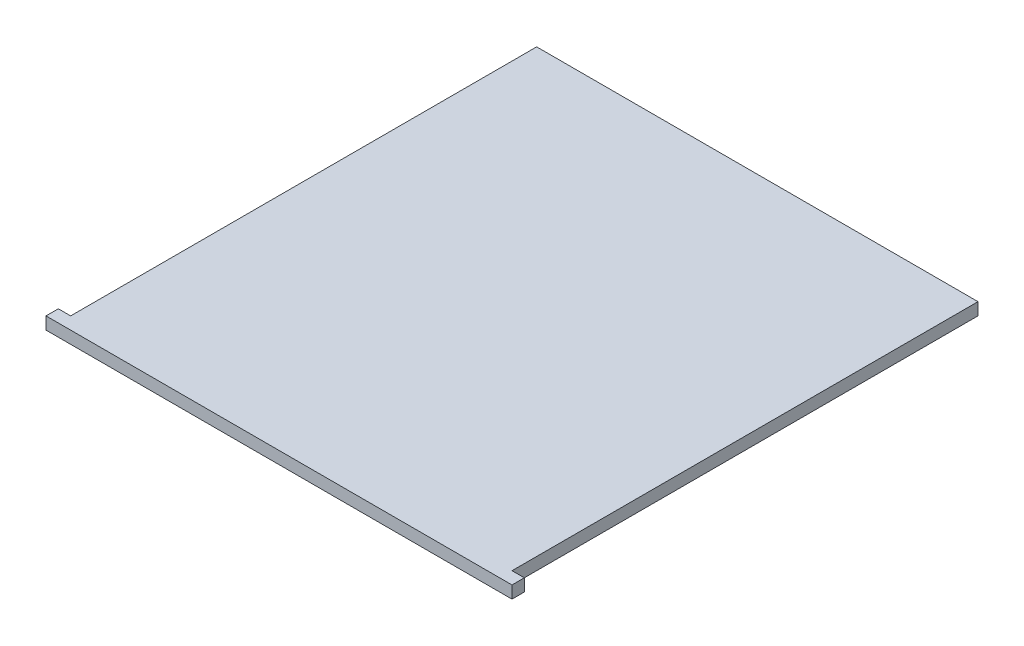
ISO-10303-21;
HEADER;
FILE_DESCRIPTION(('STEP AP214'),'2;1');
FILE_NAME('part.step','',(''),(''),'','','');
FILE_SCHEMA(('AUTOMOTIVE_DESIGN { 1 0 10303 214 1 1 1 1 }'));
ENDSEC;
DATA;
#1=APPLICATION_CONTEXT('core data for automotive mechanical design processes');
#2=APPLICATION_PROTOCOL_DEFINITION('international standard','automotive_design',2000,#1);
#3=PRODUCT_CONTEXT('',#1,'mechanical');
#4=PRODUCT('Part','Part','',(#3));
#5=PRODUCT_RELATED_PRODUCT_CATEGORY('part','',(#4));
#6=PRODUCT_DEFINITION_FORMATION('','',#4);
#7=PRODUCT_DEFINITION_CONTEXT('part definition',#1,'design');
#8=PRODUCT_DEFINITION('design','',#6,#7);
#9=PRODUCT_DEFINITION_SHAPE('','',#8);
#10=(LENGTH_UNIT() NAMED_UNIT(*) SI_UNIT(.MILLI.,.METRE.));
#11=(NAMED_UNIT(*) PLANE_ANGLE_UNIT() SI_UNIT($,.RADIAN.));
#12=(NAMED_UNIT(*) SI_UNIT($,.STERADIAN.) SOLID_ANGLE_UNIT());
#13=UNCERTAINTY_MEASURE_WITH_UNIT(LENGTH_MEASURE(1.E-05),#10,'distance_accuracy_value','');
#14=(GEOMETRIC_REPRESENTATION_CONTEXT(3) GLOBAL_UNCERTAINTY_ASSIGNED_CONTEXT((#13)) GLOBAL_UNIT_ASSIGNED_CONTEXT((#10,
#11,#12)) REPRESENTATION_CONTEXT('',''));
#15=CARTESIAN_POINT('',(0.,0.,0.));
#16=DIRECTION('',(0.,0.,1.));
#17=DIRECTION('',(1.,0.,0.));
#18=AXIS2_PLACEMENT_3D('',#15,#16,#17);
#19=CARTESIAN_POINT('',(0.,2.54,0.));
#20=DIRECTION('',(1.,0.,0.));
#21=DIRECTION('',(0.,0.,-1.));
#22=AXIS2_PLACEMENT_3D('',#19,#20,#21);
#23=PLANE('',#22);
#24=DIRECTION('',(0.,0.,1.));
#25=VECTOR('',#24,1.);
#26=CARTESIAN_POINT('',(0.,2.54,0.));
#27=LINE('',#26,#25);
#28=CARTESIAN_POINT('',(0.,2.54,-2.54));
#29=VERTEX_POINT('',#28);
#30=CARTESIAN_POINT('',(0.,2.54,0.));
#31=VERTEX_POINT('',#30);
#32=EDGE_CURVE('E117',#29,#31,#27,.T.);
#33=ORIENTED_EDGE('',*,*,#32,.F.);
#34=DIRECTION('',(0.,1.,0.));
#35=VECTOR('',#34,1.);
#36=CARTESIAN_POINT('',(0.,0.,-2.54));
#37=LINE('',#36,#35);
#38=CARTESIAN_POINT('',(0.,0.,-2.54));
#39=VERTEX_POINT('',#38);
#40=EDGE_CURVE('E158',#39,#29,#37,.T.);
#41=ORIENTED_EDGE('',*,*,#40,.F.);
#42=DIRECTION('',(0.,0.,1.));
#43=VECTOR('',#42,1.);
#44=CARTESIAN_POINT('',(0.,0.,0.));
#45=LINE('',#44,#43);
#46=CARTESIAN_POINT('',(0.,0.,0.));
#47=VERTEX_POINT('',#46);
#48=EDGE_CURVE('E140',#39,#47,#45,.T.);
#49=ORIENTED_EDGE('',*,*,#48,.T.);
#50=DIRECTION('',(0.,-1.,0.));
#51=VECTOR('',#50,1.);
#52=CARTESIAN_POINT('',(0.,2.54,0.));
#53=LINE('',#52,#51);
#54=EDGE_CURVE('E11',#31,#47,#53,.T.);
#55=ORIENTED_EDGE('',*,*,#54,.F.);
#56=EDGE_LOOP('',(#33,#41,#49,#55));
#57=FACE_BOUND('',#56,.T.);
#58=ADVANCED_FACE('F33',(#57),#23,.F.);
#59=CARTESIAN_POINT('',(0.,2.54,0.));
#60=DIRECTION('',(0.,0.,-1.));
#61=DIRECTION('',(-1.,0.,0.));
#62=AXIS2_PLACEMENT_3D('',#59,#60,#61);
#63=PLANE('',#62);
#64=DIRECTION('',(1.,0.,0.));
#65=VECTOR('',#64,1.);
#66=CARTESIAN_POINT('',(0.,0.,0.));
#67=LINE('',#66,#65);
#68=CARTESIAN_POINT('',(96.012,0.,0.));
#69=VERTEX_POINT('',#68);
#70=EDGE_CURVE('E123',#47,#69,#67,.T.);
#71=ORIENTED_EDGE('',*,*,#70,.T.);
#72=DIRECTION('',(0.,-1.,0.));
#73=VECTOR('',#72,1.);
#74=CARTESIAN_POINT('',(96.012,2.54,0.));
#75=LINE('',#74,#73);
#76=CARTESIAN_POINT('',(96.012,2.54,0.));
#77=VERTEX_POINT('',#76);
#78=EDGE_CURVE('E40',#77,#69,#75,.T.);
#79=ORIENTED_EDGE('',*,*,#78,.F.);
#80=DIRECTION('',(1.,0.,0.));
#81=VECTOR('',#80,1.);
#82=CARTESIAN_POINT('',(0.,2.54,0.));
#83=LINE('',#82,#81);
#84=EDGE_CURVE('E120',#31,#77,#83,.T.);
#85=ORIENTED_EDGE('',*,*,#84,.F.);
#86=ORIENTED_EDGE('',*,*,#54,.T.);
#87=EDGE_LOOP('',(#71,#79,#85,#86));
#88=FACE_BOUND('',#87,.T.);
#89=ADVANCED_FACE('F144',(#88),#63,.F.);
#90=CARTESIAN_POINT('',(96.012,2.54,0.));
#91=DIRECTION('',(-1.,0.,0.));
#92=DIRECTION('',(0.,0.,1.));
#93=AXIS2_PLACEMENT_3D('',#90,#91,#92);
#94=PLANE('',#93);
#95=DIRECTION('',(0.,0.,-1.));
#96=VECTOR('',#95,1.);
#97=CARTESIAN_POINT('',(96.012,0.,0.));
#98=LINE('',#97,#96);
#99=CARTESIAN_POINT('',(96.012,0.,-2.53999999999998));
#100=VERTEX_POINT('',#99);
#101=EDGE_CURVE('E118',#69,#100,#98,.T.);
#102=ORIENTED_EDGE('',*,*,#101,.T.);
#103=DIRECTION('',(0.,1.,0.));
#104=VECTOR('',#103,1.);
#105=CARTESIAN_POINT('',(96.012,0.,-2.53999999999998));
#106=LINE('',#105,#104);
#107=CARTESIAN_POINT('',(96.012,2.54,-2.53999999999998));
#108=VERTEX_POINT('',#107);
#109=EDGE_CURVE('E150',#100,#108,#106,.T.);
#110=ORIENTED_EDGE('',*,*,#109,.T.);
#111=DIRECTION('',(0.,0.,-1.));
#112=VECTOR('',#111,1.);
#113=CARTESIAN_POINT('',(96.012,2.54,0.));
#114=LINE('',#113,#112);
#115=EDGE_CURVE('E131',#77,#108,#114,.T.);
#116=ORIENTED_EDGE('',*,*,#115,.F.);
#117=ORIENTED_EDGE('',*,*,#78,.T.);
#118=EDGE_LOOP('',(#102,#110,#116,#117));
#119=FACE_BOUND('',#118,.T.);
#120=ADVANCED_FACE('F149',(#119),#94,.F.);
#121=CARTESIAN_POINT('',(0.,2.54,-98.552));
#122=DIRECTION('',(0.,0.,1.));
#123=DIRECTION('',(1.,0.,0.));
#124=AXIS2_PLACEMENT_3D('',#121,#122,#123);
#125=PLANE('',#124);
#126=DIRECTION('',(-1.,0.,0.));
#127=VECTOR('',#126,1.);
#128=CARTESIAN_POINT('',(0.,2.54,-98.552));
#129=LINE('',#128,#127);
#130=CARTESIAN_POINT('',(93.472,2.54,-98.552));
#131=VERTEX_POINT('',#130);
#132=CARTESIAN_POINT('',(2.54,2.54,-98.552));
#133=VERTEX_POINT('',#132);
#134=EDGE_CURVE('E113',#131,#133,#129,.T.);
#135=ORIENTED_EDGE('',*,*,#134,.F.);
#136=DIRECTION('',(0.,1.,0.));
#137=VECTOR('',#136,1.);
#138=CARTESIAN_POINT('',(93.472,0.,-98.552));
#139=LINE('',#138,#137);
#140=CARTESIAN_POINT('',(93.472,0.,-98.552));
#141=VERTEX_POINT('',#140);
#142=EDGE_CURVE('E101',#141,#131,#139,.T.);
#143=ORIENTED_EDGE('',*,*,#142,.F.);
#144=DIRECTION('',(-1.,0.,0.));
#145=VECTOR('',#144,1.);
#146=CARTESIAN_POINT('',(0.,0.,-98.552));
#147=LINE('',#146,#145);
#148=CARTESIAN_POINT('',(2.54,0.,-98.552));
#149=VERTEX_POINT('',#148);
#150=EDGE_CURVE('E112',#141,#149,#147,.T.);
#151=ORIENTED_EDGE('',*,*,#150,.T.);
#152=DIRECTION('',(0.,1.,0.));
#153=VECTOR('',#152,1.);
#154=CARTESIAN_POINT('',(2.54,0.,-98.552));
#155=LINE('',#154,#153);
#156=EDGE_CURVE('E141',#149,#133,#155,.T.);
#157=ORIENTED_EDGE('',*,*,#156,.T.);
#158=EDGE_LOOP('',(#135,#143,#151,#157));
#159=FACE_BOUND('',#158,.T.);
#160=ADVANCED_FACE('F110',(#159),#125,.F.);
#161=CARTESIAN_POINT('',(0.,2.54,0.));
#162=DIRECTION('',(0.,-1.,0.));
#163=DIRECTION('',(0.,0.,-1.));
#164=AXIS2_PLACEMENT_3D('',#161,#162,#163);
#165=PLANE('',#164);
#166=ORIENTED_EDGE('',*,*,#115,.T.);
#167=DIRECTION('',(1.,0.,0.));
#168=VECTOR('',#167,1.);
#169=CARTESIAN_POINT('',(96.012,2.54,-2.53999999999998));
#170=LINE('',#169,#168);
#171=CARTESIAN_POINT('',(93.472,2.54,-2.53999999999998));
#172=VERTEX_POINT('',#171);
#173=EDGE_CURVE('E106',#172,#108,#170,.T.);
#174=ORIENTED_EDGE('',*,*,#173,.F.);
#175=DIRECTION('',(0.,0.,1.));
#176=VECTOR('',#175,1.);
#177=CARTESIAN_POINT('',(93.472,2.54,-98.552));
#178=LINE('',#177,#176);
#179=EDGE_CURVE('E172',#131,#172,#178,.T.);
#180=ORIENTED_EDGE('',*,*,#179,.F.);
#181=ORIENTED_EDGE('',*,*,#134,.T.);
#182=DIRECTION('',(0.,0.,-1.));
#183=VECTOR('',#182,1.);
#184=CARTESIAN_POINT('',(2.54,2.54,-98.552));
#185=LINE('',#184,#183);
#186=CARTESIAN_POINT('',(2.54000000000001,2.54,-2.54));
#187=VERTEX_POINT('',#186);
#188=EDGE_CURVE('E163',#187,#133,#185,.T.);
#189=ORIENTED_EDGE('',*,*,#188,.F.);
#190=DIRECTION('',(1.,0.,0.));
#191=VECTOR('',#190,1.);
#192=CARTESIAN_POINT('',(0.,2.54,-2.54));
#193=LINE('',#192,#191);
#194=EDGE_CURVE('E151',#29,#187,#193,.T.);
#195=ORIENTED_EDGE('',*,*,#194,.F.);
#196=ORIENTED_EDGE('',*,*,#32,.T.);
#197=ORIENTED_EDGE('',*,*,#84,.T.);
#198=EDGE_LOOP('',(#166,#174,#180,#181,#189,#195,#196,#197));
#199=FACE_BOUND('',#198,.T.);
#200=ADVANCED_FACE('F154',(#199),#165,.F.);
#201=CARTESIAN_POINT('',(0.,0.,0.));
#202=DIRECTION('',(0.,-1.,0.));
#203=DIRECTION('',(0.,0.,-1.));
#204=AXIS2_PLACEMENT_3D('',#201,#202,#203);
#205=PLANE('',#204);
#206=DIRECTION('',(1.,0.,0.));
#207=VECTOR('',#206,1.);
#208=CARTESIAN_POINT('',(96.012,0.,-2.53999999999998));
#209=LINE('',#208,#207);
#210=CARTESIAN_POINT('',(93.472,0.,-2.53999999999998));
#211=VERTEX_POINT('',#210);
#212=EDGE_CURVE('E47',#211,#100,#209,.T.);
#213=ORIENTED_EDGE('',*,*,#212,.T.);
#214=ORIENTED_EDGE('',*,*,#101,.F.);
#215=ORIENTED_EDGE('',*,*,#70,.F.);
#216=ORIENTED_EDGE('',*,*,#48,.F.);
#217=DIRECTION('',(1.,0.,0.));
#218=VECTOR('',#217,1.);
#219=CARTESIAN_POINT('',(0.,0.,-2.54));
#220=LINE('',#219,#218);
#221=CARTESIAN_POINT('',(2.54000000000001,0.,-2.54));
#222=VERTEX_POINT('',#221);
#223=EDGE_CURVE('E165',#39,#222,#220,.T.);
#224=ORIENTED_EDGE('',*,*,#223,.T.);
#225=DIRECTION('',(0.,0.,-1.));
#226=VECTOR('',#225,1.);
#227=CARTESIAN_POINT('',(2.54,0.,-98.552));
#228=LINE('',#227,#226);
#229=EDGE_CURVE('E55',#222,#149,#228,.T.);
#230=ORIENTED_EDGE('',*,*,#229,.T.);
#231=ORIENTED_EDGE('',*,*,#150,.F.);
#232=DIRECTION('',(0.,0.,1.));
#233=VECTOR('',#232,1.);
#234=CARTESIAN_POINT('',(93.472,0.,-98.552));
#235=LINE('',#234,#233);
#236=EDGE_CURVE('E97',#141,#211,#235,.T.);
#237=ORIENTED_EDGE('',*,*,#236,.T.);
#238=EDGE_LOOP('',(#213,#214,#215,#216,#224,#230,#231,#237));
#239=FACE_BOUND('',#238,.T.);
#240=ADVANCED_FACE('F115',(#239),#205,.T.);
#241=CARTESIAN_POINT('',(2.54,0.,-98.552));
#242=DIRECTION('',(1.,0.,0.));
#243=DIRECTION('',(0.,0.,-1.));
#244=AXIS2_PLACEMENT_3D('',#241,#242,#243);
#245=PLANE('',#244);
#246=ORIENTED_EDGE('',*,*,#188,.T.);
#247=ORIENTED_EDGE('',*,*,#156,.F.);
#248=ORIENTED_EDGE('',*,*,#229,.F.);
#249=DIRECTION('',(0.,1.,0.));
#250=VECTOR('',#249,1.);
#251=CARTESIAN_POINT('',(2.54000000000001,0.,-2.54));
#252=LINE('',#251,#250);
#253=EDGE_CURVE('E160',#222,#187,#252,.T.);
#254=ORIENTED_EDGE('',*,*,#253,.T.);
#255=EDGE_LOOP('',(#246,#247,#248,#254));
#256=FACE_BOUND('',#255,.T.);
#257=ADVANCED_FACE('F183',(#256),#245,.F.);
#258=CARTESIAN_POINT('',(0.,0.,-2.54));
#259=DIRECTION('',(0.,0.,1.));
#260=DIRECTION('',(1.,0.,0.));
#261=AXIS2_PLACEMENT_3D('',#258,#259,#260);
#262=PLANE('',#261);
#263=ORIENTED_EDGE('',*,*,#194,.T.);
#264=ORIENTED_EDGE('',*,*,#253,.F.);
#265=ORIENTED_EDGE('',*,*,#223,.F.);
#266=ORIENTED_EDGE('',*,*,#40,.T.);
#267=EDGE_LOOP('',(#263,#264,#265,#266));
#268=FACE_BOUND('',#267,.T.);
#269=ADVANCED_FACE('F176',(#268),#262,.F.);
#270=CARTESIAN_POINT('',(96.012,0.,-2.53999999999998));
#271=DIRECTION('',(0.,0.,1.));
#272=DIRECTION('',(1.,0.,0.));
#273=AXIS2_PLACEMENT_3D('',#270,#271,#272);
#274=PLANE('',#273);
#275=ORIENTED_EDGE('',*,*,#173,.T.);
#276=ORIENTED_EDGE('',*,*,#109,.F.);
#277=ORIENTED_EDGE('',*,*,#212,.F.);
#278=DIRECTION('',(0.,1.,0.));
#279=VECTOR('',#278,1.);
#280=CARTESIAN_POINT('',(93.472,0.,-2.53999999999998));
#281=LINE('',#280,#279);
#282=EDGE_CURVE('E103',#211,#172,#281,.T.);
#283=ORIENTED_EDGE('',*,*,#282,.T.);
#284=EDGE_LOOP('',(#275,#276,#277,#283));
#285=FACE_BOUND('',#284,.T.);
#286=ADVANCED_FACE('F174',(#285),#274,.F.);
#287=CARTESIAN_POINT('',(93.472,0.,-98.552));
#288=DIRECTION('',(-1.,0.,0.));
#289=DIRECTION('',(0.,0.,1.));
#290=AXIS2_PLACEMENT_3D('',#287,#288,#289);
#291=PLANE('',#290);
#292=ORIENTED_EDGE('',*,*,#179,.T.);
#293=ORIENTED_EDGE('',*,*,#282,.F.);
#294=ORIENTED_EDGE('',*,*,#236,.F.);
#295=ORIENTED_EDGE('',*,*,#142,.T.);
#296=EDGE_LOOP('',(#292,#293,#294,#295));
#297=FACE_BOUND('',#296,.T.);
#298=ADVANCED_FACE('F100',(#297),#291,.F.);
#299=CLOSED_SHELL('',(#58,#89,#120,#160,#200,#240,#257,#269,#286,#298));
#300=MANIFOLD_SOLID_BREP('B2',#299);
#301=ADVANCED_BREP_SHAPE_REPRESENTATION('',(#18,#300),#14);
#302=SHAPE_DEFINITION_REPRESENTATION(#9,#301);
ENDSEC;
END-ISO-10303-21;
